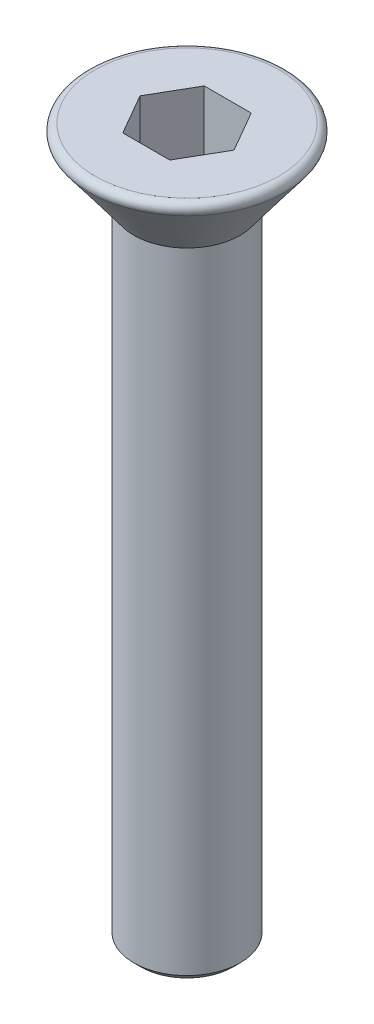
ISO-10303-21;
HEADER;
FILE_DESCRIPTION(('STEP AP214'),'2;1');
FILE_NAME('part.step','',(''),(''),'','','');
FILE_SCHEMA(('AUTOMOTIVE_DESIGN { 1 0 10303 214 1 1 1 1 }'));
ENDSEC;
DATA;
#1=APPLICATION_CONTEXT('core data for automotive mechanical design processes');
#2=APPLICATION_PROTOCOL_DEFINITION('international standard','automotive_design',2000,#1);
#3=PRODUCT_CONTEXT('',#1,'mechanical');
#4=PRODUCT('Part','Part','',(#3));
#5=PRODUCT_RELATED_PRODUCT_CATEGORY('part','',(#4));
#6=PRODUCT_DEFINITION_FORMATION('','',#4);
#7=PRODUCT_DEFINITION_CONTEXT('part definition',#1,'design');
#8=PRODUCT_DEFINITION('design','',#6,#7);
#9=PRODUCT_DEFINITION_SHAPE('','',#8);
#10=(LENGTH_UNIT() NAMED_UNIT(*) SI_UNIT(.MILLI.,.METRE.));
#11=(NAMED_UNIT(*) PLANE_ANGLE_UNIT() SI_UNIT($,.RADIAN.));
#12=(NAMED_UNIT(*) SI_UNIT($,.STERADIAN.) SOLID_ANGLE_UNIT());
#13=UNCERTAINTY_MEASURE_WITH_UNIT(LENGTH_MEASURE(1.E-05),#10,'distance_accuracy_value','');
#14=(GEOMETRIC_REPRESENTATION_CONTEXT(3) GLOBAL_UNCERTAINTY_ASSIGNED_CONTEXT((#13)) GLOBAL_UNIT_ASSIGNED_CONTEXT((#10,
#11,#12)) REPRESENTATION_CONTEXT('',''));
#15=CARTESIAN_POINT('',(0.,0.,0.));
#16=DIRECTION('',(0.,0.,1.));
#17=DIRECTION('',(1.,0.,0.));
#18=AXIS2_PLACEMENT_3D('',#15,#16,#17);
#19=CARTESIAN_POINT('',(3.,0.,0.));
#20=DIRECTION('',(0.,-1.,0.));
#21=DIRECTION('',(1.,0.,0.));
#22=AXIS2_PLACEMENT_3D('',#19,#20,#21);
#23=PLANE('',#22);
#24=CARTESIAN_POINT('',(0.,0.,0.));
#25=DIRECTION('',(0.,-1.,0.));
#26=DIRECTION('',(1.,0.,0.));
#27=AXIS2_PLACEMENT_3D('',#24,#25,#26);
#28=CIRCLE('',#27,2.6);
#29=CARTESIAN_POINT('',(2.6,0.,0.));
#30=VERTEX_POINT('',#29);
#31=EDGE_CURVE('E43',#30,#30,#28,.F.);
#32=ORIENTED_EDGE('',*,*,#31,.T.);
#33=EDGE_LOOP('',(#32));
#34=FACE_BOUND('',#33,.T.);
#35=DIRECTION('',(0.5,0.,0.866025403784439));
#36=VECTOR('',#35,1.);
#37=CARTESIAN_POINT('',(-1.32790561913614,0.,0.));
#38=LINE('',#37,#36);
#39=CARTESIAN_POINT('',(-1.32790561913614,0.,0.));
#40=VERTEX_POINT('',#39);
#41=CARTESIAN_POINT('',(-0.66395280956807,0.,1.15));
#42=VERTEX_POINT('',#41);
#43=EDGE_CURVE('E124',#40,#42,#38,.T.);
#44=ORIENTED_EDGE('',*,*,#43,.F.);
#45=DIRECTION('',(-0.5,0.,0.866025403784438));
#46=VECTOR('',#45,1.);
#47=CARTESIAN_POINT('',(-0.66395280956807,0.,-1.15));
#48=LINE('',#47,#46);
#49=CARTESIAN_POINT('',(-0.66395280956807,0.,-1.15));
#50=VERTEX_POINT('',#49);
#51=EDGE_CURVE('E50',#50,#40,#48,.T.);
#52=ORIENTED_EDGE('',*,*,#51,.F.);
#53=DIRECTION('',(-1.,0.,0.));
#54=VECTOR('',#53,1.);
#55=CARTESIAN_POINT('',(0.66395280956807,0.,-1.15));
#56=LINE('',#55,#54);
#57=CARTESIAN_POINT('',(0.66395280956807,0.,-1.15));
#58=VERTEX_POINT('',#57);
#59=EDGE_CURVE('E133',#58,#50,#56,.T.);
#60=ORIENTED_EDGE('',*,*,#59,.F.);
#61=DIRECTION('',(-0.5,0.,-0.866025403784439));
#62=VECTOR('',#61,1.);
#63=CARTESIAN_POINT('',(1.32790561913614,0.,0.));
#64=LINE('',#63,#62);
#65=CARTESIAN_POINT('',(1.32790561913614,0.,0.));
#66=VERTEX_POINT('',#65);
#67=EDGE_CURVE('E131',#66,#58,#64,.T.);
#68=ORIENTED_EDGE('',*,*,#67,.F.);
#69=DIRECTION('',(0.5,0.,-0.866025403784439));
#70=VECTOR('',#69,1.);
#71=CARTESIAN_POINT('',(0.66395280956807,0.,1.15));
#72=LINE('',#71,#70);
#73=CARTESIAN_POINT('',(0.66395280956807,0.,1.15));
#74=VERTEX_POINT('',#73);
#75=EDGE_CURVE('E98',#74,#66,#72,.T.);
#76=ORIENTED_EDGE('',*,*,#75,.F.);
#77=DIRECTION('',(1.,0.,0.));
#78=VECTOR('',#77,1.);
#79=CARTESIAN_POINT('',(-0.66395280956807,0.,1.15));
#80=LINE('',#79,#78);
#81=EDGE_CURVE('E127',#42,#74,#80,.T.);
#82=ORIENTED_EDGE('',*,*,#81,.F.);
#83=EDGE_LOOP('',(#44,#52,#60,#68,#76,#82));
#84=FACE_BOUND('',#83,.T.);
#85=ADVANCED_FACE('F35',(#34,#84),#23,.F.);
#86=CARTESIAN_POINT('',(0.,-2.,0.));
#87=DIRECTION('',(0.,1.,0.));
#88=DIRECTION('',(-1.,0.,0.));
#89=AXIS2_PLACEMENT_3D('',#86,#87,#88);
#90=CONICAL_SURFACE('',#89,1.5,0.643501108793284);
#91=CARTESIAN_POINT('',(0.,-0.32,0.));
#92=DIRECTION('',(0.,-1.,0.));
#93=DIRECTION('',(1.,0.,0.));
#94=AXIS2_PLACEMENT_3D('',#91,#92,#93);
#95=CIRCLE('',#94,2.76);
#96=CARTESIAN_POINT('',(2.76,-0.32,0.));
#97=VERTEX_POINT('',#96);
#98=EDGE_CURVE('E11',#97,#97,#95,.T.);
#99=ORIENTED_EDGE('',*,*,#98,.T.);
#100=EDGE_LOOP('',(#99));
#101=FACE_BOUND('',#100,.T.);
#102=CARTESIAN_POINT('',(0.,-2.,0.));
#103=DIRECTION('',(0.,-1.,0.));
#104=DIRECTION('',(1.,0.,0.));
#105=AXIS2_PLACEMENT_3D('',#102,#103,#104);
#106=CIRCLE('',#105,1.5);
#107=CARTESIAN_POINT('',(1.5,-2.,0.));
#108=VERTEX_POINT('',#107);
#109=EDGE_CURVE('E137',#108,#108,#106,.T.);
#110=ORIENTED_EDGE('',*,*,#109,.F.);
#111=EDGE_LOOP('',(#110));
#112=FACE_BOUND('',#111,.T.);
#113=ADVANCED_FACE('F164',(#101,#112),#90,.T.);
#114=CARTESIAN_POINT('',(0.,-20.,0.));
#115=DIRECTION('',(0.,1.,0.));
#116=DIRECTION('',(-1.,0.,0.));
#117=AXIS2_PLACEMENT_3D('',#114,#115,#116);
#118=CYLINDRICAL_SURFACE('',#117,1.5);
#119=CARTESIAN_POINT('',(0.,-19.8,0.));
#120=DIRECTION('',(0.,-1.,0.));
#121=DIRECTION('',(1.,0.,0.));
#122=AXIS2_PLACEMENT_3D('',#119,#120,#121);
#123=CIRCLE('',#122,1.5);
#124=CARTESIAN_POINT('',(1.5,-19.8,0.));
#125=VERTEX_POINT('',#124);
#126=EDGE_CURVE('E148',#125,#125,#123,.F.);
#127=ORIENTED_EDGE('',*,*,#126,.T.);
#128=EDGE_LOOP('',(#127));
#129=FACE_BOUND('',#128,.T.);
#130=ORIENTED_EDGE('',*,*,#109,.T.);
#131=EDGE_LOOP('',(#130));
#132=FACE_BOUND('',#131,.T.);
#133=ADVANCED_FACE('F169',(#129,#132),#118,.T.);
#134=CARTESIAN_POINT('',(0.,-20.,0.));
#135=DIRECTION('',(0.,-1.,0.));
#136=DIRECTION('',(1.,0.,0.));
#137=AXIS2_PLACEMENT_3D('',#134,#135,#136);
#138=PLANE('',#137);
#139=CARTESIAN_POINT('',(0.,-20.,0.));
#140=DIRECTION('',(0.,-1.,0.));
#141=DIRECTION('',(1.,0.,0.));
#142=AXIS2_PLACEMENT_3D('',#139,#140,#141);
#143=CIRCLE('',#142,1.30000000000001);
#144=CARTESIAN_POINT('',(1.30000000000001,-20.,0.));
#145=VERTEX_POINT('',#144);
#146=EDGE_CURVE('E145',#145,#145,#143,.T.);
#147=ORIENTED_EDGE('',*,*,#146,.T.);
#148=EDGE_LOOP('',(#147));
#149=FACE_BOUND('',#148,.T.);
#150=ADVANCED_FACE('F175',(#149),#138,.T.);
#151=CARTESIAN_POINT('',(-0.663952809568069,-2.,-1.15));
#152=DIRECTION('',(-0.866025403784439,0.,-0.5));
#153=DIRECTION('',(-0.5,0.,0.866025403784438));
#154=AXIS2_PLACEMENT_3D('',#151,#152,#153);
#155=PLANE('',#154);
#156=ORIENTED_EDGE('',*,*,#51,.T.);
#157=DIRECTION('',(0.,1.,0.));
#158=VECTOR('',#157,1.);
#159=CARTESIAN_POINT('',(-1.32790561913614,-2.,0.));
#160=LINE('',#159,#158);
#161=CARTESIAN_POINT('',(-1.32790561913614,-2.,0.));
#162=VERTEX_POINT('',#161);
#163=EDGE_CURVE('E80',#162,#40,#160,.T.);
#164=ORIENTED_EDGE('',*,*,#163,.F.);
#165=DIRECTION('',(-0.5,0.,0.866025403784438));
#166=VECTOR('',#165,1.);
#167=CARTESIAN_POINT('',(-0.663952809568069,-2.,-1.15));
#168=LINE('',#167,#166);
#169=CARTESIAN_POINT('',(-0.663952809568069,-2.,-1.15));
#170=VERTEX_POINT('',#169);
#171=EDGE_CURVE('E135',#170,#162,#168,.T.);
#172=ORIENTED_EDGE('',*,*,#171,.F.);
#173=DIRECTION('',(0.,1.,0.));
#174=VECTOR('',#173,1.);
#175=CARTESIAN_POINT('',(-0.663952809568069,-2.,-1.15));
#176=LINE('',#175,#174);
#177=EDGE_CURVE('E58',#170,#50,#176,.T.);
#178=ORIENTED_EDGE('',*,*,#177,.T.);
#179=EDGE_LOOP('',(#156,#164,#172,#178));
#180=FACE_BOUND('',#179,.T.);
#181=ADVANCED_FACE('F179',(#180),#155,.F.);
#182=CARTESIAN_POINT('',(0.66395280956807,-2.,-1.15));
#183=DIRECTION('',(0.,0.,-1.));
#184=DIRECTION('',(-1.,0.,0.));
#185=AXIS2_PLACEMENT_3D('',#182,#183,#184);
#186=PLANE('',#185);
#187=ORIENTED_EDGE('',*,*,#59,.T.);
#188=ORIENTED_EDGE('',*,*,#177,.F.);
#189=DIRECTION('',(-1.,0.,0.));
#190=VECTOR('',#189,1.);
#191=CARTESIAN_POINT('',(0.66395280956807,-2.,-1.15));
#192=LINE('',#191,#190);
#193=CARTESIAN_POINT('',(0.66395280956807,-2.,-1.15));
#194=VERTEX_POINT('',#193);
#195=EDGE_CURVE('E110',#194,#170,#192,.T.);
#196=ORIENTED_EDGE('',*,*,#195,.F.);
#197=DIRECTION('',(0.,1.,0.));
#198=VECTOR('',#197,1.);
#199=CARTESIAN_POINT('',(0.66395280956807,-2.,-1.15));
#200=LINE('',#199,#198);
#201=EDGE_CURVE('E102',#194,#58,#200,.T.);
#202=ORIENTED_EDGE('',*,*,#201,.T.);
#203=EDGE_LOOP('',(#187,#188,#196,#202));
#204=FACE_BOUND('',#203,.T.);
#205=ADVANCED_FACE('F183',(#204),#186,.F.);
#206=CARTESIAN_POINT('',(1.32790561913614,-2.,0.));
#207=DIRECTION('',(0.866025403784439,0.,-0.5));
#208=DIRECTION('',(-0.5,0.,-0.866025403784439));
#209=AXIS2_PLACEMENT_3D('',#206,#207,#208);
#210=PLANE('',#209);
#211=ORIENTED_EDGE('',*,*,#67,.T.);
#212=ORIENTED_EDGE('',*,*,#201,.F.);
#213=DIRECTION('',(-0.5,0.,-0.866025403784439));
#214=VECTOR('',#213,1.);
#215=CARTESIAN_POINT('',(1.32790561913614,-2.,0.));
#216=LINE('',#215,#214);
#217=CARTESIAN_POINT('',(1.32790561913614,-2.,0.));
#218=VERTEX_POINT('',#217);
#219=EDGE_CURVE('E106',#218,#194,#216,.T.);
#220=ORIENTED_EDGE('',*,*,#219,.F.);
#221=DIRECTION('',(0.,1.,0.));
#222=VECTOR('',#221,1.);
#223=CARTESIAN_POINT('',(1.32790561913614,-2.,0.));
#224=LINE('',#223,#222);
#225=EDGE_CURVE('E91',#218,#66,#224,.T.);
#226=ORIENTED_EDGE('',*,*,#225,.T.);
#227=EDGE_LOOP('',(#211,#212,#220,#226));
#228=FACE_BOUND('',#227,.T.);
#229=ADVANCED_FACE('F107',(#228),#210,.F.);
#230=CARTESIAN_POINT('',(0.66395280956807,-2.,1.15));
#231=DIRECTION('',(0.866025403784439,0.,0.5));
#232=DIRECTION('',(0.5,0.,-0.866025403784439));
#233=AXIS2_PLACEMENT_3D('',#230,#231,#232);
#234=PLANE('',#233);
#235=ORIENTED_EDGE('',*,*,#75,.T.);
#236=ORIENTED_EDGE('',*,*,#225,.F.);
#237=DIRECTION('',(0.5,0.,-0.866025403784439));
#238=VECTOR('',#237,1.);
#239=CARTESIAN_POINT('',(0.66395280956807,-2.,1.15));
#240=LINE('',#239,#238);
#241=CARTESIAN_POINT('',(0.66395280956807,-2.,1.15));
#242=VERTEX_POINT('',#241);
#243=EDGE_CURVE('E95',#242,#218,#240,.T.);
#244=ORIENTED_EDGE('',*,*,#243,.F.);
#245=DIRECTION('',(0.,1.,0.));
#246=VECTOR('',#245,1.);
#247=CARTESIAN_POINT('',(0.66395280956807,-2.,1.15));
#248=LINE('',#247,#246);
#249=EDGE_CURVE('E103',#242,#74,#248,.T.);
#250=ORIENTED_EDGE('',*,*,#249,.T.);
#251=EDGE_LOOP('',(#235,#236,#244,#250));
#252=FACE_BOUND('',#251,.T.);
#253=ADVANCED_FACE('F93',(#252),#234,.F.);
#254=CARTESIAN_POINT('',(-0.66395280956807,-2.,1.15));
#255=DIRECTION('',(0.,0.,1.));
#256=DIRECTION('',(1.,0.,0.));
#257=AXIS2_PLACEMENT_3D('',#254,#255,#256);
#258=PLANE('',#257);
#259=ORIENTED_EDGE('',*,*,#81,.T.);
#260=ORIENTED_EDGE('',*,*,#249,.F.);
#261=DIRECTION('',(1.,0.,0.));
#262=VECTOR('',#261,1.);
#263=CARTESIAN_POINT('',(-0.66395280956807,-2.,1.15));
#264=LINE('',#263,#262);
#265=CARTESIAN_POINT('',(-0.66395280956807,-2.,1.15));
#266=VERTEX_POINT('',#265);
#267=EDGE_CURVE('E116',#266,#242,#264,.T.);
#268=ORIENTED_EDGE('',*,*,#267,.F.);
#269=DIRECTION('',(0.,1.,0.));
#270=VECTOR('',#269,1.);
#271=CARTESIAN_POINT('',(-0.66395280956807,-2.,1.15));
#272=LINE('',#271,#270);
#273=EDGE_CURVE('E140',#266,#42,#272,.T.);
#274=ORIENTED_EDGE('',*,*,#273,.T.);
#275=EDGE_LOOP('',(#259,#260,#268,#274));
#276=FACE_BOUND('',#275,.T.);
#277=ADVANCED_FACE('F187',(#276),#258,.F.);
#278=CARTESIAN_POINT('',(-1.32790561913614,-2.,0.));
#279=DIRECTION('',(-0.866025403784439,0.,0.5));
#280=DIRECTION('',(0.5,0.,0.866025403784439));
#281=AXIS2_PLACEMENT_3D('',#278,#279,#280);
#282=PLANE('',#281);
#283=ORIENTED_EDGE('',*,*,#43,.T.);
#284=ORIENTED_EDGE('',*,*,#273,.F.);
#285=DIRECTION('',(0.5,0.,0.866025403784439));
#286=VECTOR('',#285,1.);
#287=CARTESIAN_POINT('',(-1.32790561913614,-2.,0.));
#288=LINE('',#287,#286);
#289=EDGE_CURVE('E118',#162,#266,#288,.T.);
#290=ORIENTED_EDGE('',*,*,#289,.F.);
#291=ORIENTED_EDGE('',*,*,#163,.T.);
#292=EDGE_LOOP('',(#283,#284,#290,#291));
#293=FACE_BOUND('',#292,.T.);
#294=ADVANCED_FACE('F184',(#293),#282,.F.);
#295=CARTESIAN_POINT('',(0.,-2.,0.));
#296=DIRECTION('',(0.,1.,0.));
#297=DIRECTION('',(-1.,0.,0.));
#298=AXIS2_PLACEMENT_3D('',#295,#296,#297);
#299=PLANE('',#298);
#300=ORIENTED_EDGE('',*,*,#171,.T.);
#301=ORIENTED_EDGE('',*,*,#289,.T.);
#302=ORIENTED_EDGE('',*,*,#267,.T.);
#303=ORIENTED_EDGE('',*,*,#243,.T.);
#304=ORIENTED_EDGE('',*,*,#219,.T.);
#305=ORIENTED_EDGE('',*,*,#195,.T.);
#306=EDGE_LOOP('',(#300,#301,#302,#303,#304,#305));
#307=FACE_BOUND('',#306,.T.);
#308=ADVANCED_FACE('F113',(#307),#299,.T.);
#309=CARTESIAN_POINT('',(0.,-20.,0.));
#310=DIRECTION('',(0.,1.,0.));
#311=DIRECTION('',(-1.,0.,0.));
#312=AXIS2_PLACEMENT_3D('',#309,#310,#311);
#313=CONICAL_SURFACE('',#312,1.30000000000001,0.785398163397445);
#314=ORIENTED_EDGE('',*,*,#126,.F.);
#315=EDGE_LOOP('',(#314));
#316=FACE_BOUND('',#315,.T.);
#317=ORIENTED_EDGE('',*,*,#146,.F.);
#318=EDGE_LOOP('',(#317));
#319=FACE_BOUND('',#318,.T.);
#320=ADVANCED_FACE('F156',(#316,#319),#313,.T.);
#321=CARTESIAN_POINT('',(0.,-0.2,0.));
#322=DIRECTION('',(0.,-1.,0.));
#323=DIRECTION('',(1.,0.,0.));
#324=AXIS2_PLACEMENT_3D('',#321,#322,#323);
#325=TOROIDAL_SURFACE('',#324,2.6,0.2);
#326=ORIENTED_EDGE('',*,*,#98,.F.);
#327=EDGE_LOOP('',(#326));
#328=FACE_BOUND('',#327,.T.);
#329=ORIENTED_EDGE('',*,*,#31,.F.);
#330=EDGE_LOOP('',(#329));
#331=FACE_BOUND('',#330,.T.);
#332=ADVANCED_FACE('F37',(#328,#331),#325,.T.);
#333=CLOSED_SHELL('',(#85,#113,#133,#150,#181,#205,#229,#253,#277,#294,#308,#320,#332));
#334=MANIFOLD_SOLID_BREP('B2',#333);
#335=ADVANCED_BREP_SHAPE_REPRESENTATION('',(#18,#334),#14);
#336=SHAPE_DEFINITION_REPRESENTATION(#9,#335);
ENDSEC;
END-ISO-10303-21;
